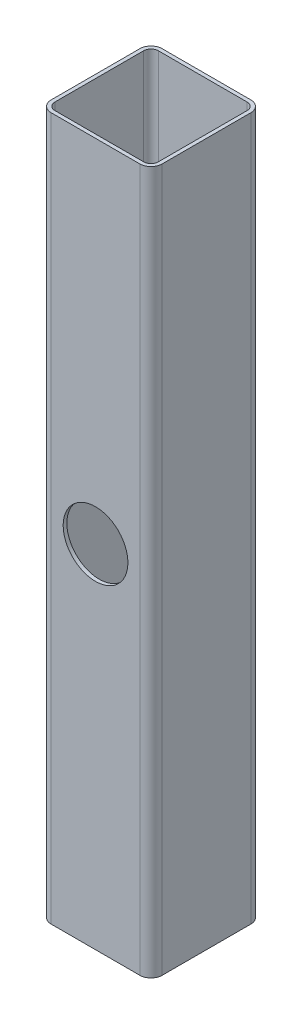
ISO-10303-21;
HEADER;
FILE_DESCRIPTION(('STEP AP214'),'2;1');
FILE_NAME('part.step','',(''),(''),'','','');
FILE_SCHEMA(('AUTOMOTIVE_DESIGN { 1 0 10303 214 1 1 1 1 }'));
ENDSEC;
DATA;
#1=APPLICATION_CONTEXT('core data for automotive mechanical design processes');
#2=APPLICATION_PROTOCOL_DEFINITION('international standard','automotive_design',2000,#1);
#3=PRODUCT_CONTEXT('',#1,'mechanical');
#4=PRODUCT('Part','Part','',(#3));
#5=PRODUCT_RELATED_PRODUCT_CATEGORY('part','',(#4));
#6=PRODUCT_DEFINITION_FORMATION('','',#4);
#7=PRODUCT_DEFINITION_CONTEXT('part definition',#1,'design');
#8=PRODUCT_DEFINITION('design','',#6,#7);
#9=PRODUCT_DEFINITION_SHAPE('','',#8);
#10=(LENGTH_UNIT() NAMED_UNIT(*) SI_UNIT(.MILLI.,.METRE.));
#11=(NAMED_UNIT(*) PLANE_ANGLE_UNIT() SI_UNIT($,.RADIAN.));
#12=(NAMED_UNIT(*) SI_UNIT($,.STERADIAN.) SOLID_ANGLE_UNIT());
#13=UNCERTAINTY_MEASURE_WITH_UNIT(LENGTH_MEASURE(1.E-05),#10,'distance_accuracy_value','');
#14=(GEOMETRIC_REPRESENTATION_CONTEXT(3) GLOBAL_UNCERTAINTY_ASSIGNED_CONTEXT((#13)) GLOBAL_UNIT_ASSIGNED_CONTEXT((#10,
#11,#12)) REPRESENTATION_CONTEXT('',''));
#15=CARTESIAN_POINT('',(0.,0.,0.));
#16=DIRECTION('',(0.,0.,1.));
#17=DIRECTION('',(1.,0.,0.));
#18=AXIS2_PLACEMENT_3D('',#15,#16,#17);
#19=CARTESIAN_POINT('',(24.,190.,24.));
#20=DIRECTION('',(0.,-1.,0.));
#21=DIRECTION('',(0.,0.,-1.));
#22=AXIS2_PLACEMENT_3D('',#19,#20,#21);
#23=PLANE('',#22);
#24=CARTESIAN_POINT('',(24.,190.,24.));
#25=DIRECTION('',(0.,1.,0.));
#26=DIRECTION('',(0.,0.,-1.));
#27=AXIS2_PLACEMENT_3D('',#24,#25,#26);
#28=CIRCLE('',#27,6.);
#29=CARTESIAN_POINT('',(24.,190.,30.));
#30=VERTEX_POINT('',#29);
#31=CARTESIAN_POINT('',(30.,190.,24.));
#32=VERTEX_POINT('',#31);
#33=EDGE_CURVE('E201',#30,#32,#28,.T.);
#34=ORIENTED_EDGE('',*,*,#33,.T.);
#35=DIRECTION('',(0.,0.,-1.));
#36=VECTOR('',#35,1.);
#37=CARTESIAN_POINT('',(30.,190.,24.));
#38=LINE('',#37,#36);
#39=CARTESIAN_POINT('',(30.,190.,-24.));
#40=VERTEX_POINT('',#39);
#41=EDGE_CURVE('E204',#32,#40,#38,.T.);
#42=ORIENTED_EDGE('',*,*,#41,.T.);
#43=CARTESIAN_POINT('',(24.,190.,-24.));
#44=DIRECTION('',(0.,1.,0.));
#45=DIRECTION('',(0.,0.,1.));
#46=AXIS2_PLACEMENT_3D('',#43,#44,#45);
#47=CIRCLE('',#46,6.);
#48=CARTESIAN_POINT('',(24.,190.,-30.));
#49=VERTEX_POINT('',#48);
#50=EDGE_CURVE('E207',#40,#49,#47,.T.);
#51=ORIENTED_EDGE('',*,*,#50,.T.);
#52=DIRECTION('',(-1.,0.,0.));
#53=VECTOR('',#52,1.);
#54=CARTESIAN_POINT('',(-24.,190.,-30.));
#55=LINE('',#54,#53);
#56=CARTESIAN_POINT('',(-24.,190.,-30.));
#57=VERTEX_POINT('',#56);
#58=EDGE_CURVE('E209',#49,#57,#55,.T.);
#59=ORIENTED_EDGE('',*,*,#58,.T.);
#60=CARTESIAN_POINT('',(-24.,190.,-24.));
#61=DIRECTION('',(0.,1.,0.));
#62=DIRECTION('',(0.,0.,1.));
#63=AXIS2_PLACEMENT_3D('',#60,#61,#62);
#64=CIRCLE('',#63,6.);
#65=CARTESIAN_POINT('',(-30.,190.,-24.));
#66=VERTEX_POINT('',#65);
#67=EDGE_CURVE('E211',#57,#66,#64,.T.);
#68=ORIENTED_EDGE('',*,*,#67,.T.);
#69=DIRECTION('',(0.,0.,1.));
#70=VECTOR('',#69,1.);
#71=CARTESIAN_POINT('',(-30.,190.,24.));
#72=LINE('',#71,#70);
#73=CARTESIAN_POINT('',(-30.,190.,24.));
#74=VERTEX_POINT('',#73);
#75=EDGE_CURVE('E213',#66,#74,#72,.T.);
#76=ORIENTED_EDGE('',*,*,#75,.T.);
#77=CARTESIAN_POINT('',(-24.,190.,24.));
#78=DIRECTION('',(0.,1.,0.));
#79=DIRECTION('',(0.,0.,-1.));
#80=AXIS2_PLACEMENT_3D('',#77,#78,#79);
#81=CIRCLE('',#80,6.);
#82=CARTESIAN_POINT('',(-24.,190.,30.));
#83=VERTEX_POINT('',#82);
#84=EDGE_CURVE('E215',#74,#83,#81,.T.);
#85=ORIENTED_EDGE('',*,*,#84,.T.);
#86=DIRECTION('',(1.,0.,0.));
#87=VECTOR('',#86,1.);
#88=CARTESIAN_POINT('',(-24.,190.,30.));
#89=LINE('',#88,#87);
#90=EDGE_CURVE('E217',#83,#30,#89,.T.);
#91=ORIENTED_EDGE('',*,*,#90,.T.);
#92=EDGE_LOOP('',(#34,#42,#51,#59,#68,#76,#85,#91));
#93=FACE_BOUND('',#92,.T.);
#94=CARTESIAN_POINT('',(24.,190.,24.));
#95=DIRECTION('',(0.,-1.,0.));
#96=DIRECTION('',(0.,0.,-1.));
#97=AXIS2_PLACEMENT_3D('',#94,#95,#96);
#98=CIRCLE('',#97,4.);
#99=CARTESIAN_POINT('',(24.,190.,28.));
#100=VERTEX_POINT('',#99);
#101=CARTESIAN_POINT('',(28.,190.,24.));
#102=VERTEX_POINT('',#101);
#103=EDGE_CURVE('E172',#100,#102,#98,.F.);
#104=ORIENTED_EDGE('',*,*,#103,.F.);
#105=DIRECTION('',(1.,0.,0.));
#106=VECTOR('',#105,1.);
#107=CARTESIAN_POINT('',(24.,190.,28.));
#108=LINE('',#107,#106);
#109=CARTESIAN_POINT('',(-24.,190.,28.));
#110=VERTEX_POINT('',#109);
#111=EDGE_CURVE('E153',#110,#100,#108,.T.);
#112=ORIENTED_EDGE('',*,*,#111,.F.);
#113=CARTESIAN_POINT('',(-24.,190.,24.));
#114=DIRECTION('',(0.,-1.,0.));
#115=DIRECTION('',(0.,0.,-1.));
#116=AXIS2_PLACEMENT_3D('',#113,#114,#115);
#117=CIRCLE('',#116,4.);
#118=CARTESIAN_POINT('',(-28.,190.,24.));
#119=VERTEX_POINT('',#118);
#120=EDGE_CURVE('E198',#119,#110,#117,.F.);
#121=ORIENTED_EDGE('',*,*,#120,.F.);
#122=DIRECTION('',(0.,0.,1.));
#123=VECTOR('',#122,1.);
#124=CARTESIAN_POINT('',(-28.,190.,24.));
#125=LINE('',#124,#123);
#126=CARTESIAN_POINT('',(-28.,190.,-24.));
#127=VERTEX_POINT('',#126);
#128=EDGE_CURVE('E196',#127,#119,#125,.T.);
#129=ORIENTED_EDGE('',*,*,#128,.F.);
#130=CARTESIAN_POINT('',(-24.,190.,-24.));
#131=DIRECTION('',(0.,-1.,0.));
#132=DIRECTION('',(0.,0.,-1.));
#133=AXIS2_PLACEMENT_3D('',#130,#131,#132);
#134=CIRCLE('',#133,4.);
#135=CARTESIAN_POINT('',(-24.,190.,-28.));
#136=VERTEX_POINT('',#135);
#137=EDGE_CURVE('E194',#136,#127,#134,.F.);
#138=ORIENTED_EDGE('',*,*,#137,.F.);
#139=DIRECTION('',(-1.,0.,0.));
#140=VECTOR('',#139,1.);
#141=CARTESIAN_POINT('',(24.,190.,-28.));
#142=LINE('',#141,#140);
#143=CARTESIAN_POINT('',(24.,190.,-28.));
#144=VERTEX_POINT('',#143);
#145=EDGE_CURVE('E192',#144,#136,#142,.T.);
#146=ORIENTED_EDGE('',*,*,#145,.F.);
#147=CARTESIAN_POINT('',(24.,190.,-24.));
#148=DIRECTION('',(0.,-1.,0.));
#149=DIRECTION('',(0.,0.,-1.));
#150=AXIS2_PLACEMENT_3D('',#147,#148,#149);
#151=CIRCLE('',#150,4.);
#152=CARTESIAN_POINT('',(28.,190.,-24.));
#153=VERTEX_POINT('',#152);
#154=EDGE_CURVE('E190',#153,#144,#151,.F.);
#155=ORIENTED_EDGE('',*,*,#154,.F.);
#156=DIRECTION('',(0.,0.,-1.));
#157=VECTOR('',#156,1.);
#158=CARTESIAN_POINT('',(28.,190.,24.));
#159=LINE('',#158,#157);
#160=EDGE_CURVE('E174',#102,#153,#159,.T.);
#161=ORIENTED_EDGE('',*,*,#160,.F.);
#162=EDGE_LOOP('',(#104,#112,#121,#129,#138,#146,#155,#161));
#163=FACE_BOUND('',#162,.T.);
#164=ADVANCED_FACE('F33',(#93,#163),#23,.F.);
#165=CARTESIAN_POINT('',(24.,-190.,24.));
#166=DIRECTION('',(0.,-1.,0.));
#167=DIRECTION('',(0.,0.,-1.));
#168=AXIS2_PLACEMENT_3D('',#165,#166,#167);
#169=PLANE('',#168);
#170=CARTESIAN_POINT('',(24.,-190.,24.));
#171=DIRECTION('',(0.,1.,0.));
#172=DIRECTION('',(0.,0.,-1.));
#173=AXIS2_PLACEMENT_3D('',#170,#171,#172);
#174=CIRCLE('',#173,6.);
#175=CARTESIAN_POINT('',(24.,-190.,30.));
#176=VERTEX_POINT('',#175);
#177=CARTESIAN_POINT('',(30.,-190.,24.));
#178=VERTEX_POINT('',#177);
#179=EDGE_CURVE('E220',#176,#178,#174,.T.);
#180=ORIENTED_EDGE('',*,*,#179,.F.);
#181=DIRECTION('',(1.,0.,0.));
#182=VECTOR('',#181,1.);
#183=CARTESIAN_POINT('',(-24.,-190.,30.));
#184=LINE('',#183,#182);
#185=CARTESIAN_POINT('',(-24.,-190.,30.));
#186=VERTEX_POINT('',#185);
#187=EDGE_CURVE('E205',#186,#176,#184,.T.);
#188=ORIENTED_EDGE('',*,*,#187,.F.);
#189=CARTESIAN_POINT('',(-24.,-190.,24.));
#190=DIRECTION('',(0.,1.,0.));
#191=DIRECTION('',(0.,0.,-1.));
#192=AXIS2_PLACEMENT_3D('',#189,#190,#191);
#193=CIRCLE('',#192,6.);
#194=CARTESIAN_POINT('',(-30.,-190.,24.));
#195=VERTEX_POINT('',#194);
#196=EDGE_CURVE('E233',#195,#186,#193,.T.);
#197=ORIENTED_EDGE('',*,*,#196,.F.);
#198=DIRECTION('',(0.,0.,1.));
#199=VECTOR('',#198,1.);
#200=CARTESIAN_POINT('',(-30.,-190.,24.));
#201=LINE('',#200,#199);
#202=CARTESIAN_POINT('',(-30.,-190.,-24.));
#203=VERTEX_POINT('',#202);
#204=EDGE_CURVE('E231',#203,#195,#201,.T.);
#205=ORIENTED_EDGE('',*,*,#204,.F.);
#206=CARTESIAN_POINT('',(-24.,-190.,-24.));
#207=DIRECTION('',(0.,1.,0.));
#208=DIRECTION('',(0.,0.,1.));
#209=AXIS2_PLACEMENT_3D('',#206,#207,#208);
#210=CIRCLE('',#209,6.);
#211=CARTESIAN_POINT('',(-24.,-190.,-30.));
#212=VERTEX_POINT('',#211);
#213=EDGE_CURVE('E229',#212,#203,#210,.T.);
#214=ORIENTED_EDGE('',*,*,#213,.F.);
#215=DIRECTION('',(-1.,0.,0.));
#216=VECTOR('',#215,1.);
#217=CARTESIAN_POINT('',(-24.,-190.,-30.));
#218=LINE('',#217,#216);
#219=CARTESIAN_POINT('',(24.,-190.,-30.));
#220=VERTEX_POINT('',#219);
#221=EDGE_CURVE('E227',#220,#212,#218,.T.);
#222=ORIENTED_EDGE('',*,*,#221,.F.);
#223=CARTESIAN_POINT('',(24.,-190.,-24.));
#224=DIRECTION('',(0.,1.,0.));
#225=DIRECTION('',(0.,0.,1.));
#226=AXIS2_PLACEMENT_3D('',#223,#224,#225);
#227=CIRCLE('',#226,6.);
#228=CARTESIAN_POINT('',(30.,-190.,-24.));
#229=VERTEX_POINT('',#228);
#230=EDGE_CURVE('E225',#229,#220,#227,.T.);
#231=ORIENTED_EDGE('',*,*,#230,.F.);
#232=DIRECTION('',(0.,0.,-1.));
#233=VECTOR('',#232,1.);
#234=CARTESIAN_POINT('',(30.,-190.,24.));
#235=LINE('',#234,#233);
#236=EDGE_CURVE('E223',#178,#229,#235,.T.);
#237=ORIENTED_EDGE('',*,*,#236,.F.);
#238=EDGE_LOOP('',(#180,#188,#197,#205,#214,#222,#231,#237));
#239=FACE_BOUND('',#238,.T.);
#240=DIRECTION('',(1.,0.,0.));
#241=VECTOR('',#240,1.);
#242=CARTESIAN_POINT('',(24.,-190.,28.));
#243=LINE('',#242,#241);
#244=CARTESIAN_POINT('',(-24.,-190.,28.));
#245=VERTEX_POINT('',#244);
#246=CARTESIAN_POINT('',(24.,-190.,28.));
#247=VERTEX_POINT('',#246);
#248=EDGE_CURVE('E150',#245,#247,#243,.T.);
#249=ORIENTED_EDGE('',*,*,#248,.T.);
#250=CARTESIAN_POINT('',(24.,-190.,24.));
#251=DIRECTION('',(0.,-1.,0.));
#252=DIRECTION('',(0.,0.,-1.));
#253=AXIS2_PLACEMENT_3D('',#250,#251,#252);
#254=CIRCLE('',#253,4.);
#255=CARTESIAN_POINT('',(28.,-190.,24.));
#256=VERTEX_POINT('',#255);
#257=EDGE_CURVE('E159',#247,#256,#254,.F.);
#258=ORIENTED_EDGE('',*,*,#257,.T.);
#259=DIRECTION('',(0.,0.,-1.));
#260=VECTOR('',#259,1.);
#261=CARTESIAN_POINT('',(28.,-190.,24.));
#262=LINE('',#261,#260);
#263=CARTESIAN_POINT('',(28.,-190.,-24.));
#264=VERTEX_POINT('',#263);
#265=EDGE_CURVE('E165',#256,#264,#262,.T.);
#266=ORIENTED_EDGE('',*,*,#265,.T.);
#267=CARTESIAN_POINT('',(24.,-190.,-24.));
#268=DIRECTION('',(0.,-1.,0.));
#269=DIRECTION('',(0.,0.,-1.));
#270=AXIS2_PLACEMENT_3D('',#267,#268,#269);
#271=CIRCLE('',#270,4.);
#272=CARTESIAN_POINT('',(24.,-190.,-28.));
#273=VERTEX_POINT('',#272);
#274=EDGE_CURVE('E57',#264,#273,#271,.F.);
#275=ORIENTED_EDGE('',*,*,#274,.T.);
#276=DIRECTION('',(-1.,0.,0.));
#277=VECTOR('',#276,1.);
#278=CARTESIAN_POINT('',(24.,-190.,-28.));
#279=LINE('',#278,#277);
#280=CARTESIAN_POINT('',(-24.,-190.,-28.));
#281=VERTEX_POINT('',#280);
#282=EDGE_CURVE('E184',#273,#281,#279,.T.);
#283=ORIENTED_EDGE('',*,*,#282,.T.);
#284=CARTESIAN_POINT('',(-24.,-190.,-24.));
#285=DIRECTION('',(0.,-1.,0.));
#286=DIRECTION('',(0.,0.,-1.));
#287=AXIS2_PLACEMENT_3D('',#284,#285,#286);
#288=CIRCLE('',#287,4.);
#289=CARTESIAN_POINT('',(-28.,-190.,-24.));
#290=VERTEX_POINT('',#289);
#291=EDGE_CURVE('E181',#281,#290,#288,.F.);
#292=ORIENTED_EDGE('',*,*,#291,.T.);
#293=DIRECTION('',(0.,0.,1.));
#294=VECTOR('',#293,1.);
#295=CARTESIAN_POINT('',(-28.,-190.,24.));
#296=LINE('',#295,#294);
#297=CARTESIAN_POINT('',(-28.,-190.,24.));
#298=VERTEX_POINT('',#297);
#299=EDGE_CURVE('E176',#290,#298,#296,.T.);
#300=ORIENTED_EDGE('',*,*,#299,.T.);
#301=CARTESIAN_POINT('',(-24.,-190.,24.));
#302=DIRECTION('',(0.,-1.,0.));
#303=DIRECTION('',(0.,0.,-1.));
#304=AXIS2_PLACEMENT_3D('',#301,#302,#303);
#305=CIRCLE('',#304,4.);
#306=EDGE_CURVE('E171',#298,#245,#305,.F.);
#307=ORIENTED_EDGE('',*,*,#306,.T.);
#308=EDGE_LOOP('',(#249,#258,#266,#275,#283,#292,#300,#307));
#309=FACE_BOUND('',#308,.T.);
#310=ADVANCED_FACE('F168',(#239,#309),#169,.T.);
#311=CARTESIAN_POINT('',(24.,190.,24.));
#312=DIRECTION('',(0.,-1.,0.));
#313=DIRECTION('',(0.,0.,-1.));
#314=AXIS2_PLACEMENT_3D('',#311,#312,#313);
#315=CYLINDRICAL_SURFACE('',#314,6.);
#316=ORIENTED_EDGE('',*,*,#179,.T.);
#317=DIRECTION('',(0.,-1.,0.));
#318=VECTOR('',#317,1.);
#319=CARTESIAN_POINT('',(30.,190.,24.));
#320=LINE('',#319,#318);
#321=EDGE_CURVE('E11',#32,#178,#320,.T.);
#322=ORIENTED_EDGE('',*,*,#321,.F.);
#323=ORIENTED_EDGE('',*,*,#33,.F.);
#324=DIRECTION('',(0.,-1.,0.));
#325=VECTOR('',#324,1.);
#326=CARTESIAN_POINT('',(24.,190.,30.));
#327=LINE('',#326,#325);
#328=EDGE_CURVE('E219',#30,#176,#327,.T.);
#329=ORIENTED_EDGE('',*,*,#328,.T.);
#330=EDGE_LOOP('',(#316,#322,#323,#329));
#331=FACE_BOUND('',#330,.T.);
#332=ADVANCED_FACE('F35',(#331),#315,.T.);
#333=CARTESIAN_POINT('',(30.,190.,24.));
#334=DIRECTION('',(-1.,0.,0.));
#335=DIRECTION('',(0.,0.,1.));
#336=AXIS2_PLACEMENT_3D('',#333,#334,#335);
#337=PLANE('',#336);
#338=ORIENTED_EDGE('',*,*,#236,.T.);
#339=DIRECTION('',(0.,-1.,0.));
#340=VECTOR('',#339,1.);
#341=CARTESIAN_POINT('',(30.,190.,-24.));
#342=LINE('',#341,#340);
#343=EDGE_CURVE('E42',#40,#229,#342,.T.);
#344=ORIENTED_EDGE('',*,*,#343,.F.);
#345=ORIENTED_EDGE('',*,*,#41,.F.);
#346=ORIENTED_EDGE('',*,*,#321,.T.);
#347=EDGE_LOOP('',(#338,#344,#345,#346));
#348=FACE_BOUND('',#347,.T.);
#349=ADVANCED_FACE('F280',(#348),#337,.F.);
#350=CARTESIAN_POINT('',(24.,190.,-24.));
#351=DIRECTION('',(0.,-1.,0.));
#352=DIRECTION('',(0.,0.,-1.));
#353=AXIS2_PLACEMENT_3D('',#350,#351,#352);
#354=CYLINDRICAL_SURFACE('',#353,6.);
#355=ORIENTED_EDGE('',*,*,#230,.T.);
#356=DIRECTION('',(0.,-1.,0.));
#357=VECTOR('',#356,1.);
#358=CARTESIAN_POINT('',(24.,190.,-30.));
#359=LINE('',#358,#357);
#360=EDGE_CURVE('E250',#49,#220,#359,.T.);
#361=ORIENTED_EDGE('',*,*,#360,.F.);
#362=ORIENTED_EDGE('',*,*,#50,.F.);
#363=ORIENTED_EDGE('',*,*,#343,.T.);
#364=EDGE_LOOP('',(#355,#361,#362,#363));
#365=FACE_BOUND('',#364,.T.);
#366=ADVANCED_FACE('F258',(#365),#354,.T.);
#367=CARTESIAN_POINT('',(-24.,190.,-30.));
#368=DIRECTION('',(0.,0.,1.));
#369=DIRECTION('',(1.,0.,0.));
#370=AXIS2_PLACEMENT_3D('',#367,#368,#369);
#371=PLANE('',#370);
#372=CARTESIAN_POINT('',(0.,0.,-30.));
#373=DIRECTION('',(0.,0.,-1.));
#374=DIRECTION('',(-1.,0.,0.));
#375=AXIS2_PLACEMENT_3D('',#372,#373,#374);
#376=CIRCLE('',#375,17.5);
#377=CARTESIAN_POINT('',(-17.5,0.,-30.));
#378=VERTEX_POINT('',#377);
#379=EDGE_CURVE('E322',#378,#378,#376,.T.);
#380=ORIENTED_EDGE('',*,*,#379,.F.);
#381=EDGE_LOOP('',(#380));
#382=FACE_BOUND('',#381,.T.);
#383=ORIENTED_EDGE('',*,*,#221,.T.);
#384=DIRECTION('',(0.,-1.,0.));
#385=VECTOR('',#384,1.);
#386=CARTESIAN_POINT('',(-24.,190.,-30.));
#387=LINE('',#386,#385);
#388=EDGE_CURVE('E247',#57,#212,#387,.T.);
#389=ORIENTED_EDGE('',*,*,#388,.F.);
#390=ORIENTED_EDGE('',*,*,#58,.F.);
#391=ORIENTED_EDGE('',*,*,#360,.T.);
#392=EDGE_LOOP('',(#383,#389,#390,#391));
#393=FACE_BOUND('',#392,.T.);
#394=ADVANCED_FACE('F268',(#382,#393),#371,.F.);
#395=CARTESIAN_POINT('',(-24.,190.,-24.));
#396=DIRECTION('',(0.,-1.,0.));
#397=DIRECTION('',(0.,0.,-1.));
#398=AXIS2_PLACEMENT_3D('',#395,#396,#397);
#399=CYLINDRICAL_SURFACE('',#398,6.);
#400=ORIENTED_EDGE('',*,*,#213,.T.);
#401=DIRECTION('',(0.,-1.,0.));
#402=VECTOR('',#401,1.);
#403=CARTESIAN_POINT('',(-30.,190.,-24.));
#404=LINE('',#403,#402);
#405=EDGE_CURVE('E244',#66,#203,#404,.T.);
#406=ORIENTED_EDGE('',*,*,#405,.F.);
#407=ORIENTED_EDGE('',*,*,#67,.F.);
#408=ORIENTED_EDGE('',*,*,#388,.T.);
#409=EDGE_LOOP('',(#400,#406,#407,#408));
#410=FACE_BOUND('',#409,.T.);
#411=ADVANCED_FACE('F272',(#410),#399,.T.);
#412=CARTESIAN_POINT('',(-30.,190.,24.));
#413=DIRECTION('',(1.,0.,0.));
#414=DIRECTION('',(0.,0.,-1.));
#415=AXIS2_PLACEMENT_3D('',#412,#413,#414);
#416=PLANE('',#415);
#417=ORIENTED_EDGE('',*,*,#204,.T.);
#418=DIRECTION('',(0.,-1.,0.));
#419=VECTOR('',#418,1.);
#420=CARTESIAN_POINT('',(-30.,190.,24.));
#421=LINE('',#420,#419);
#422=EDGE_CURVE('E241',#74,#195,#421,.T.);
#423=ORIENTED_EDGE('',*,*,#422,.F.);
#424=ORIENTED_EDGE('',*,*,#75,.F.);
#425=ORIENTED_EDGE('',*,*,#405,.T.);
#426=EDGE_LOOP('',(#417,#423,#424,#425));
#427=FACE_BOUND('',#426,.T.);
#428=ADVANCED_FACE('F293',(#427),#416,.F.);
#429=CARTESIAN_POINT('',(-24.,190.,24.));
#430=DIRECTION('',(0.,-1.,0.));
#431=DIRECTION('',(0.,0.,-1.));
#432=AXIS2_PLACEMENT_3D('',#429,#430,#431);
#433=CYLINDRICAL_SURFACE('',#432,6.);
#434=ORIENTED_EDGE('',*,*,#196,.T.);
#435=DIRECTION('',(0.,-1.,0.));
#436=VECTOR('',#435,1.);
#437=CARTESIAN_POINT('',(-24.,190.,30.));
#438=LINE('',#437,#436);
#439=EDGE_CURVE('E238',#83,#186,#438,.T.);
#440=ORIENTED_EDGE('',*,*,#439,.F.);
#441=ORIENTED_EDGE('',*,*,#84,.F.);
#442=ORIENTED_EDGE('',*,*,#422,.T.);
#443=EDGE_LOOP('',(#434,#440,#441,#442));
#444=FACE_BOUND('',#443,.T.);
#445=ADVANCED_FACE('F291',(#444),#433,.T.);
#446=CARTESIAN_POINT('',(-24.,190.,30.));
#447=DIRECTION('',(0.,0.,-1.));
#448=DIRECTION('',(-1.,0.,0.));
#449=AXIS2_PLACEMENT_3D('',#446,#447,#448);
#450=PLANE('',#449);
#451=CARTESIAN_POINT('',(0.,0.,30.));
#452=DIRECTION('',(0.,0.,-1.));
#453=DIRECTION('',(-1.,0.,0.));
#454=AXIS2_PLACEMENT_3D('',#451,#452,#453);
#455=CIRCLE('',#454,17.5);
#456=CARTESIAN_POINT('',(-17.5,0.,30.));
#457=VERTEX_POINT('',#456);
#458=EDGE_CURVE('E320',#457,#457,#455,.T.);
#459=ORIENTED_EDGE('',*,*,#458,.T.);
#460=EDGE_LOOP('',(#459));
#461=FACE_BOUND('',#460,.T.);
#462=ORIENTED_EDGE('',*,*,#187,.T.);
#463=ORIENTED_EDGE('',*,*,#328,.F.);
#464=ORIENTED_EDGE('',*,*,#90,.F.);
#465=ORIENTED_EDGE('',*,*,#439,.T.);
#466=EDGE_LOOP('',(#462,#463,#464,#465));
#467=FACE_BOUND('',#466,.T.);
#468=ADVANCED_FACE('F286',(#461,#467),#450,.F.);
#469=CARTESIAN_POINT('',(24.,190.,24.));
#470=DIRECTION('',(0.,-1.,0.));
#471=DIRECTION('',(0.,0.,-1.));
#472=AXIS2_PLACEMENT_3D('',#469,#470,#471);
#473=CYLINDRICAL_SURFACE('',#472,4.);
#474=ORIENTED_EDGE('',*,*,#257,.F.);
#475=DIRECTION('',(0.,-1.,0.));
#476=VECTOR('',#475,1.);
#477=CARTESIAN_POINT('',(24.,190.,28.));
#478=LINE('',#477,#476);
#479=EDGE_CURVE('E146',#100,#247,#478,.T.);
#480=ORIENTED_EDGE('',*,*,#479,.F.);
#481=ORIENTED_EDGE('',*,*,#103,.T.);
#482=DIRECTION('',(0.,1.,0.));
#483=VECTOR('',#482,1.);
#484=CARTESIAN_POINT('',(28.,190.,24.));
#485=LINE('',#484,#483);
#486=EDGE_CURVE('E162',#102,#256,#485,.F.);
#487=ORIENTED_EDGE('',*,*,#486,.T.);
#488=EDGE_LOOP('',(#474,#480,#481,#487));
#489=FACE_BOUND('',#488,.T.);
#490=ADVANCED_FACE('F160',(#489),#473,.F.);
#491=CARTESIAN_POINT('',(28.,190.,24.));
#492=DIRECTION('',(-1.,0.,0.));
#493=DIRECTION('',(0.,0.,1.));
#494=AXIS2_PLACEMENT_3D('',#491,#492,#493);
#495=PLANE('',#494);
#496=ORIENTED_EDGE('',*,*,#265,.F.);
#497=ORIENTED_EDGE('',*,*,#486,.F.);
#498=ORIENTED_EDGE('',*,*,#160,.T.);
#499=DIRECTION('',(0.,-1.,0.));
#500=VECTOR('',#499,1.);
#501=CARTESIAN_POINT('',(28.,190.,-24.));
#502=LINE('',#501,#500);
#503=EDGE_CURVE('E330',#153,#264,#502,.T.);
#504=ORIENTED_EDGE('',*,*,#503,.T.);
#505=EDGE_LOOP('',(#496,#497,#498,#504));
#506=FACE_BOUND('',#505,.T.);
#507=ADVANCED_FACE('F316',(#506),#495,.T.);
#508=CARTESIAN_POINT('',(24.,190.,-24.));
#509=DIRECTION('',(0.,-1.,0.));
#510=DIRECTION('',(0.,0.,-1.));
#511=AXIS2_PLACEMENT_3D('',#508,#509,#510);
#512=CYLINDRICAL_SURFACE('',#511,4.);
#513=ORIENTED_EDGE('',*,*,#274,.F.);
#514=ORIENTED_EDGE('',*,*,#503,.F.);
#515=ORIENTED_EDGE('',*,*,#154,.T.);
#516=DIRECTION('',(0.,1.,0.));
#517=VECTOR('',#516,1.);
#518=CARTESIAN_POINT('',(24.,190.,-28.));
#519=LINE('',#518,#517);
#520=EDGE_CURVE('E333',#144,#273,#519,.F.);
#521=ORIENTED_EDGE('',*,*,#520,.T.);
#522=EDGE_LOOP('',(#513,#514,#515,#521));
#523=FACE_BOUND('',#522,.T.);
#524=ADVANCED_FACE('F362',(#523),#512,.F.);
#525=CARTESIAN_POINT('',(-24.,190.,-28.));
#526=DIRECTION('',(0.,0.,1.));
#527=DIRECTION('',(1.,0.,0.));
#528=AXIS2_PLACEMENT_3D('',#525,#526,#527);
#529=PLANE('',#528);
#530=CARTESIAN_POINT('',(0.,0.,-28.));
#531=DIRECTION('',(0.,0.,1.));
#532=DIRECTION('',(1.,0.,0.));
#533=AXIS2_PLACEMENT_3D('',#530,#531,#532);
#534=CIRCLE('',#533,17.5);
#535=CARTESIAN_POINT('',(17.5,0.,-28.));
#536=VERTEX_POINT('',#535);
#537=EDGE_CURVE('E166',#536,#536,#534,.T.);
#538=ORIENTED_EDGE('',*,*,#537,.F.);
#539=EDGE_LOOP('',(#538));
#540=FACE_BOUND('',#539,.T.);
#541=ORIENTED_EDGE('',*,*,#282,.F.);
#542=ORIENTED_EDGE('',*,*,#520,.F.);
#543=ORIENTED_EDGE('',*,*,#145,.T.);
#544=DIRECTION('',(0.,-1.,0.));
#545=VECTOR('',#544,1.);
#546=CARTESIAN_POINT('',(-24.,190.,-28.));
#547=LINE('',#546,#545);
#548=EDGE_CURVE('E335',#136,#281,#547,.T.);
#549=ORIENTED_EDGE('',*,*,#548,.T.);
#550=EDGE_LOOP('',(#541,#542,#543,#549));
#551=FACE_BOUND('',#550,.T.);
#552=ADVANCED_FACE('F352',(#540,#551),#529,.T.);
#553=CARTESIAN_POINT('',(-24.,190.,-24.));
#554=DIRECTION('',(0.,-1.,0.));
#555=DIRECTION('',(0.,0.,-1.));
#556=AXIS2_PLACEMENT_3D('',#553,#554,#555);
#557=CYLINDRICAL_SURFACE('',#556,4.);
#558=ORIENTED_EDGE('',*,*,#291,.F.);
#559=ORIENTED_EDGE('',*,*,#548,.F.);
#560=ORIENTED_EDGE('',*,*,#137,.T.);
#561=DIRECTION('',(0.,1.,0.));
#562=VECTOR('',#561,1.);
#563=CARTESIAN_POINT('',(-28.,190.,-24.));
#564=LINE('',#563,#562);
#565=EDGE_CURVE('E337',#127,#290,#564,.F.);
#566=ORIENTED_EDGE('',*,*,#565,.T.);
#567=EDGE_LOOP('',(#558,#559,#560,#566));
#568=FACE_BOUND('',#567,.T.);
#569=ADVANCED_FACE('F357',(#568),#557,.F.);
#570=CARTESIAN_POINT('',(-28.,190.,24.));
#571=DIRECTION('',(1.,0.,0.));
#572=DIRECTION('',(0.,0.,-1.));
#573=AXIS2_PLACEMENT_3D('',#570,#571,#572);
#574=PLANE('',#573);
#575=ORIENTED_EDGE('',*,*,#299,.F.);
#576=ORIENTED_EDGE('',*,*,#565,.F.);
#577=ORIENTED_EDGE('',*,*,#128,.T.);
#578=DIRECTION('',(0.,-1.,0.));
#579=VECTOR('',#578,1.);
#580=CARTESIAN_POINT('',(-28.,190.,24.));
#581=LINE('',#580,#579);
#582=EDGE_CURVE('E339',#119,#298,#581,.T.);
#583=ORIENTED_EDGE('',*,*,#582,.T.);
#584=EDGE_LOOP('',(#575,#576,#577,#583));
#585=FACE_BOUND('',#584,.T.);
#586=ADVANCED_FACE('F361',(#585),#574,.T.);
#587=CARTESIAN_POINT('',(-24.,190.,24.));
#588=DIRECTION('',(0.,-1.,0.));
#589=DIRECTION('',(0.,0.,-1.));
#590=AXIS2_PLACEMENT_3D('',#587,#588,#589);
#591=CYLINDRICAL_SURFACE('',#590,4.);
#592=ORIENTED_EDGE('',*,*,#306,.F.);
#593=ORIENTED_EDGE('',*,*,#582,.F.);
#594=ORIENTED_EDGE('',*,*,#120,.T.);
#595=DIRECTION('',(0.,1.,0.));
#596=VECTOR('',#595,1.);
#597=CARTESIAN_POINT('',(-24.,190.,28.));
#598=LINE('',#597,#596);
#599=EDGE_CURVE('E49',#110,#245,#598,.F.);
#600=ORIENTED_EDGE('',*,*,#599,.T.);
#601=EDGE_LOOP('',(#592,#593,#594,#600));
#602=FACE_BOUND('',#601,.T.);
#603=ADVANCED_FACE('F341',(#602),#591,.F.);
#604=CARTESIAN_POINT('',(-24.,190.,28.));
#605=DIRECTION('',(0.,0.,-1.));
#606=DIRECTION('',(-1.,0.,0.));
#607=AXIS2_PLACEMENT_3D('',#604,#605,#606);
#608=PLANE('',#607);
#609=CARTESIAN_POINT('',(0.,0.,28.));
#610=DIRECTION('',(0.,0.,-1.));
#611=DIRECTION('',(-1.,0.,0.));
#612=AXIS2_PLACEMENT_3D('',#609,#610,#611);
#613=CIRCLE('',#612,17.5);
#614=CARTESIAN_POINT('',(-17.5,0.,28.));
#615=VERTEX_POINT('',#614);
#616=EDGE_CURVE('E37',#615,#615,#613,.T.);
#617=ORIENTED_EDGE('',*,*,#616,.F.);
#618=EDGE_LOOP('',(#617));
#619=FACE_BOUND('',#618,.T.);
#620=ORIENTED_EDGE('',*,*,#248,.F.);
#621=ORIENTED_EDGE('',*,*,#599,.F.);
#622=ORIENTED_EDGE('',*,*,#111,.T.);
#623=ORIENTED_EDGE('',*,*,#479,.T.);
#624=EDGE_LOOP('',(#620,#621,#622,#623));
#625=FACE_BOUND('',#624,.T.);
#626=ADVANCED_FACE('F148',(#619,#625),#608,.T.);
#627=CARTESIAN_POINT('',(0.,0.,30.));
#628=DIRECTION('',(0.,0.,-1.));
#629=DIRECTION('',(-1.,0.,0.));
#630=AXIS2_PLACEMENT_3D('',#627,#628,#629);
#631=CYLINDRICAL_SURFACE('',#630,17.5);
#632=ORIENTED_EDGE('',*,*,#616,.T.);
#633=EDGE_LOOP('',(#632));
#634=FACE_BOUND('',#633,.T.);
#635=ORIENTED_EDGE('',*,*,#458,.F.);
#636=EDGE_LOOP('',(#635));
#637=FACE_BOUND('',#636,.T.);
#638=ADVANCED_FACE('F380',(#634,#637),#631,.F.);
#639=ORIENTED_EDGE('',*,*,#537,.T.);
#640=EDGE_LOOP('',(#639));
#641=FACE_BOUND('',#640,.T.);
#642=ORIENTED_EDGE('',*,*,#379,.T.);
#643=EDGE_LOOP('',(#642));
#644=FACE_BOUND('',#643,.T.);
#645=ADVANCED_FACE('F385',(#641,#644),#631,.F.);
#646=CLOSED_SHELL('',(#164,#310,#332,#349,#366,#394,#411,#428,#445,#468,#490,#507,#524,#552,
#569,#586,#603,#626,#638,#645));
#647=MANIFOLD_SOLID_BREP('B2',#646);
#648=ADVANCED_BREP_SHAPE_REPRESENTATION('',(#18,#647),#14);
#649=SHAPE_DEFINITION_REPRESENTATION(#9,#648);
ENDSEC;
END-ISO-10303-21;
